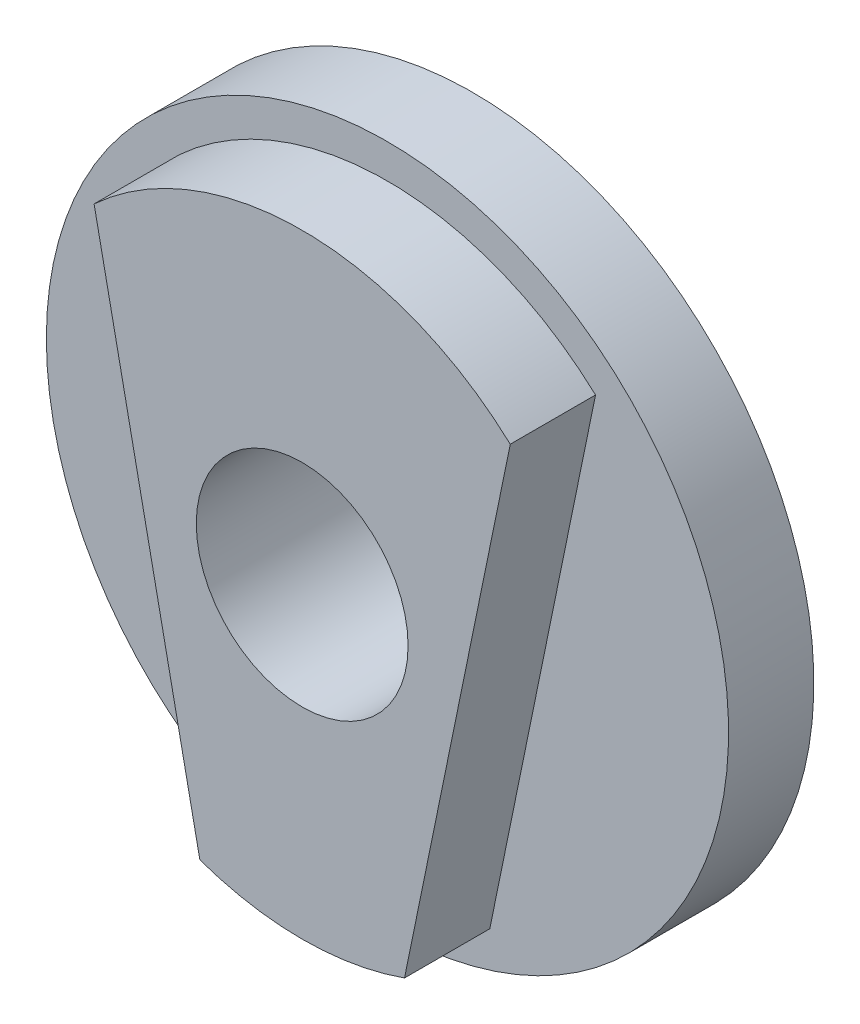
ISO-10303-21;
HEADER;
FILE_DESCRIPTION(('STEP AP214'),'2;1');
FILE_NAME('part.step','',(''),(''),'','','');
FILE_SCHEMA(('AUTOMOTIVE_DESIGN { 1 0 10303 214 1 1 1 1 }'));
ENDSEC;
DATA;
#1=APPLICATION_CONTEXT('core data for automotive mechanical design processes');
#2=APPLICATION_PROTOCOL_DEFINITION('international standard','automotive_design',2000,#1);
#3=PRODUCT_CONTEXT('',#1,'mechanical');
#4=PRODUCT('Part','Part','',(#3));
#5=PRODUCT_RELATED_PRODUCT_CATEGORY('part','',(#4));
#6=PRODUCT_DEFINITION_FORMATION('','',#4);
#7=PRODUCT_DEFINITION_CONTEXT('part definition',#1,'design');
#8=PRODUCT_DEFINITION('design','',#6,#7);
#9=PRODUCT_DEFINITION_SHAPE('','',#8);
#10=(LENGTH_UNIT() NAMED_UNIT(*) SI_UNIT(.MILLI.,.METRE.));
#11=(NAMED_UNIT(*) PLANE_ANGLE_UNIT() SI_UNIT($,.RADIAN.));
#12=(NAMED_UNIT(*) SI_UNIT($,.STERADIAN.) SOLID_ANGLE_UNIT());
#13=UNCERTAINTY_MEASURE_WITH_UNIT(LENGTH_MEASURE(1.E-05),#10,'distance_accuracy_value','');
#14=(GEOMETRIC_REPRESENTATION_CONTEXT(3) GLOBAL_UNCERTAINTY_ASSIGNED_CONTEXT((#13)) GLOBAL_UNIT_ASSIGNED_CONTEXT((#10,
#11,#12)) REPRESENTATION_CONTEXT('',''));
#15=CARTESIAN_POINT('',(0.,0.,0.));
#16=DIRECTION('',(0.,0.,1.));
#17=DIRECTION('',(1.,0.,0.));
#18=AXIS2_PLACEMENT_3D('',#15,#16,#17);
#19=CARTESIAN_POINT('',(1.,0.,0.425));
#20=DIRECTION('',(0.,0.,1.));
#21=DIRECTION('',(1.,0.,0.));
#22=AXIS2_PLACEMENT_3D('',#19,#20,#21);
#23=PLANE('',#22);
#24=CARTESIAN_POINT('',(0.,0.,0.425));
#25=DIRECTION('',(0.,0.,-1.));
#26=DIRECTION('',(-1.,0.,0.));
#27=AXIS2_PLACEMENT_3D('',#24,#25,#26);
#28=CIRCLE('',#27,1.);
#29=CARTESIAN_POINT('',(-1.,0.,0.425));
#30=VERTEX_POINT('',#29);
#31=EDGE_CURVE('E11',#30,#30,#28,.T.);
#32=ORIENTED_EDGE('',*,*,#31,.F.);
#33=EDGE_LOOP('',(#32));
#34=FACE_BOUND('',#33,.T.);
#35=DIRECTION('',(0.201077921145965,0.979575249599344,0.));
#36=VECTOR('',#35,1.);
#37=CARTESIAN_POINT('',(0.610011396574978,0.661729624581403,0.425));
#38=LINE('',#37,#36);
#39=CARTESIAN_POINT('',(0.3,-0.848528137423857,0.425));
#40=VERTEX_POINT('',#39);
#41=CARTESIAN_POINT('',(0.610011396574979,0.661729624581404,0.425));
#42=VERTEX_POINT('',#41);
#43=EDGE_CURVE('E91',#40,#42,#38,.T.);
#44=ORIENTED_EDGE('',*,*,#43,.F.);
#45=CARTESIAN_POINT('',(0.,0.,0.425));
#46=DIRECTION('',(0.,0.,1.));
#47=DIRECTION('',(1.,0.,0.));
#48=AXIS2_PLACEMENT_3D('',#45,#46,#47);
#49=CIRCLE('',#48,0.899999999999999);
#50=CARTESIAN_POINT('',(-0.299999999999994,-0.848528137423857,0.425));
#51=VERTEX_POINT('',#50);
#52=EDGE_CURVE('E102',#51,#40,#49,.T.);
#53=ORIENTED_EDGE('',*,*,#52,.F.);
#54=DIRECTION('',(0.201077921145972,-0.979575249599343,0.));
#55=VECTOR('',#54,1.);
#56=CARTESIAN_POINT('',(-0.610011396574983,0.661729624581403,0.425));
#57=LINE('',#56,#55);
#58=CARTESIAN_POINT('',(-0.610011396574983,0.661729624581403,0.425));
#59=VERTEX_POINT('',#58);
#60=EDGE_CURVE('E72',#59,#51,#57,.T.);
#61=ORIENTED_EDGE('',*,*,#60,.F.);
#62=CARTESIAN_POINT('',(0.,0.,0.425));
#63=DIRECTION('',(0.,0.,1.));
#64=DIRECTION('',(1.,0.,0.));
#65=AXIS2_PLACEMENT_3D('',#62,#63,#64);
#66=CIRCLE('',#65,0.900000000000001);
#67=EDGE_CURVE('E107',#42,#59,#66,.T.);
#68=ORIENTED_EDGE('',*,*,#67,.F.);
#69=EDGE_LOOP('',(#44,#53,#61,#68));
#70=FACE_BOUND('',#69,.T.);
#71=ADVANCED_FACE('F35',(#34,#70),#23,.T.);
#72=CARTESIAN_POINT('',(0.,0.,0.425));
#73=DIRECTION('',(0.,0.,-1.));
#74=DIRECTION('',(-1.,0.,0.));
#75=AXIS2_PLACEMENT_3D('',#72,#73,#74);
#76=CYLINDRICAL_SURFACE('',#75,1.);
#77=ORIENTED_EDGE('',*,*,#31,.T.);
#78=EDGE_LOOP('',(#77));
#79=FACE_BOUND('',#78,.T.);
#80=CARTESIAN_POINT('',(0.,0.,0.175));
#81=DIRECTION('',(0.,0.,-1.));
#82=DIRECTION('',(-1.,0.,0.));
#83=AXIS2_PLACEMENT_3D('',#80,#81,#82);
#84=CIRCLE('',#83,1.);
#85=CARTESIAN_POINT('',(-1.,0.,0.175));
#86=VERTEX_POINT('',#85);
#87=EDGE_CURVE('E43',#86,#86,#84,.T.);
#88=ORIENTED_EDGE('',*,*,#87,.F.);
#89=EDGE_LOOP('',(#88));
#90=FACE_BOUND('',#89,.T.);
#91=ADVANCED_FACE('F37',(#79,#90),#76,.T.);
#92=CARTESIAN_POINT('',(0.,0.,0.175));
#93=DIRECTION('',(0.,0.,-1.));
#94=DIRECTION('',(-1.,0.,0.));
#95=AXIS2_PLACEMENT_3D('',#92,#93,#94);
#96=PLANE('',#95);
#97=CARTESIAN_POINT('',(0.,0.,0.175));
#98=DIRECTION('',(0.,0.,-1.));
#99=DIRECTION('',(-1.,0.,0.));
#100=AXIS2_PLACEMENT_3D('',#97,#98,#99);
#101=CIRCLE('',#100,0.3105);
#102=CARTESIAN_POINT('',(-0.3105,0.,0.175));
#103=VERTEX_POINT('',#102);
#104=EDGE_CURVE('E105',#103,#103,#101,.T.);
#105=ORIENTED_EDGE('',*,*,#104,.F.);
#106=EDGE_LOOP('',(#105));
#107=FACE_BOUND('',#106,.T.);
#108=ORIENTED_EDGE('',*,*,#87,.T.);
#109=EDGE_LOOP('',(#108));
#110=FACE_BOUND('',#109,.T.);
#111=ADVANCED_FACE('F115',(#107,#110),#96,.T.);
#112=CARTESIAN_POINT('',(0.,0.,0.675));
#113=DIRECTION('',(0.,0.,-1.));
#114=DIRECTION('',(-1.,0.,0.));
#115=AXIS2_PLACEMENT_3D('',#112,#113,#114);
#116=CYLINDRICAL_SURFACE('',#115,0.899999999999999);
#117=ORIENTED_EDGE('',*,*,#52,.T.);
#118=DIRECTION('',(0.,0.,-1.));
#119=VECTOR('',#118,1.);
#120=CARTESIAN_POINT('',(0.3,-0.848528137423857,0.675));
#121=LINE('',#120,#119);
#122=CARTESIAN_POINT('',(0.3,-0.848528137423857,0.675));
#123=VERTEX_POINT('',#122);
#124=EDGE_CURVE('E94',#123,#40,#121,.T.);
#125=ORIENTED_EDGE('',*,*,#124,.F.);
#126=CARTESIAN_POINT('',(0.,0.,0.675));
#127=DIRECTION('',(0.,0.,1.));
#128=DIRECTION('',(1.,0.,0.));
#129=AXIS2_PLACEMENT_3D('',#126,#127,#128);
#130=CIRCLE('',#129,0.899999999999999);
#131=CARTESIAN_POINT('',(-0.299999999999994,-0.848528137423857,0.675));
#132=VERTEX_POINT('',#131);
#133=EDGE_CURVE('E84',#132,#123,#130,.T.);
#134=ORIENTED_EDGE('',*,*,#133,.F.);
#135=DIRECTION('',(0.,0.,-1.));
#136=VECTOR('',#135,1.);
#137=CARTESIAN_POINT('',(-0.299999999999994,-0.848528137423857,0.675));
#138=LINE('',#137,#136);
#139=EDGE_CURVE('E98',#132,#51,#138,.T.);
#140=ORIENTED_EDGE('',*,*,#139,.T.);
#141=EDGE_LOOP('',(#117,#125,#134,#140));
#142=FACE_BOUND('',#141,.T.);
#143=ADVANCED_FACE('F123',(#142),#116,.T.);
#144=CARTESIAN_POINT('',(0.610011396574978,0.661729624581403,0.675));
#145=DIRECTION('',(-0.979575249599344,0.201077921145965,0.));
#146=DIRECTION('',(-0.201077921145965,-0.979575249599344,0.));
#147=AXIS2_PLACEMENT_3D('',#144,#145,#146);
#148=PLANE('',#147);
#149=ORIENTED_EDGE('',*,*,#43,.T.);
#150=DIRECTION('',(0.,0.,-1.));
#151=VECTOR('',#150,1.);
#152=CARTESIAN_POINT('',(0.610011396574979,0.661729624581404,0.675));
#153=LINE('',#152,#151);
#154=CARTESIAN_POINT('',(0.610011396574979,0.661729624581404,0.675));
#155=VERTEX_POINT('',#154);
#156=EDGE_CURVE('E88',#155,#42,#153,.T.);
#157=ORIENTED_EDGE('',*,*,#156,.F.);
#158=DIRECTION('',(0.201077921145965,0.979575249599344,0.));
#159=VECTOR('',#158,1.);
#160=CARTESIAN_POINT('',(0.610011396574978,0.661729624581403,0.675));
#161=LINE('',#160,#159);
#162=EDGE_CURVE('E79',#123,#155,#161,.T.);
#163=ORIENTED_EDGE('',*,*,#162,.F.);
#164=ORIENTED_EDGE('',*,*,#124,.T.);
#165=EDGE_LOOP('',(#149,#157,#163,#164));
#166=FACE_BOUND('',#165,.T.);
#167=ADVANCED_FACE('F89',(#166),#148,.F.);
#168=CARTESIAN_POINT('',(0.,0.,0.675));
#169=DIRECTION('',(0.,0.,-1.));
#170=DIRECTION('',(-1.,0.,0.));
#171=AXIS2_PLACEMENT_3D('',#168,#169,#170);
#172=CYLINDRICAL_SURFACE('',#171,0.900000000000001);
#173=ORIENTED_EDGE('',*,*,#67,.T.);
#174=DIRECTION('',(0.,0.,-1.));
#175=VECTOR('',#174,1.);
#176=CARTESIAN_POINT('',(-0.610011396574983,0.661729624581403,0.675));
#177=LINE('',#176,#175);
#178=CARTESIAN_POINT('',(-0.610011396574983,0.661729624581403,0.675));
#179=VERTEX_POINT('',#178);
#180=EDGE_CURVE('E50',#179,#59,#177,.T.);
#181=ORIENTED_EDGE('',*,*,#180,.F.);
#182=CARTESIAN_POINT('',(0.,0.,0.675));
#183=DIRECTION('',(0.,0.,1.));
#184=DIRECTION('',(1.,0.,0.));
#185=AXIS2_PLACEMENT_3D('',#182,#183,#184);
#186=CIRCLE('',#185,0.900000000000001);
#187=EDGE_CURVE('E82',#155,#179,#186,.T.);
#188=ORIENTED_EDGE('',*,*,#187,.F.);
#189=ORIENTED_EDGE('',*,*,#156,.T.);
#190=EDGE_LOOP('',(#173,#181,#188,#189));
#191=FACE_BOUND('',#190,.T.);
#192=ADVANCED_FACE('F96',(#191),#172,.T.);
#193=CARTESIAN_POINT('',(-0.610011396574983,0.661729624581403,0.675));
#194=DIRECTION('',(0.979575249599343,0.201077921145972,0.));
#195=DIRECTION('',(-0.201077921145972,0.979575249599343,0.));
#196=AXIS2_PLACEMENT_3D('',#193,#194,#195);
#197=PLANE('',#196);
#198=ORIENTED_EDGE('',*,*,#60,.T.);
#199=ORIENTED_EDGE('',*,*,#139,.F.);
#200=DIRECTION('',(0.201077921145972,-0.979575249599343,0.));
#201=VECTOR('',#200,1.);
#202=CARTESIAN_POINT('',(-0.610011396574983,0.661729624581403,0.675));
#203=LINE('',#202,#201);
#204=EDGE_CURVE('E58',#179,#132,#203,.T.);
#205=ORIENTED_EDGE('',*,*,#204,.F.);
#206=ORIENTED_EDGE('',*,*,#180,.T.);
#207=EDGE_LOOP('',(#198,#199,#205,#206));
#208=FACE_BOUND('',#207,.T.);
#209=ADVANCED_FACE('F131',(#208),#197,.F.);
#210=CARTESIAN_POINT('',(0.,0.,0.675));
#211=DIRECTION('',(0.,0.,1.));
#212=DIRECTION('',(1.,0.,0.));
#213=AXIS2_PLACEMENT_3D('',#210,#211,#212);
#214=PLANE('',#213);
#215=CARTESIAN_POINT('',(0.,0.,0.675));
#216=DIRECTION('',(0.,0.,1.));
#217=DIRECTION('',(1.,0.,0.));
#218=AXIS2_PLACEMENT_3D('',#215,#216,#217);
#219=CIRCLE('',#218,0.3105);
#220=CARTESIAN_POINT('',(0.3105,0.,0.675));
#221=VERTEX_POINT('',#220);
#222=EDGE_CURVE('E193',#221,#221,#219,.T.);
#223=ORIENTED_EDGE('',*,*,#222,.F.);
#224=EDGE_LOOP('',(#223));
#225=FACE_BOUND('',#224,.T.);
#226=ORIENTED_EDGE('',*,*,#133,.T.);
#227=ORIENTED_EDGE('',*,*,#162,.T.);
#228=ORIENTED_EDGE('',*,*,#187,.T.);
#229=ORIENTED_EDGE('',*,*,#204,.T.);
#230=EDGE_LOOP('',(#226,#227,#228,#229));
#231=FACE_BOUND('',#230,.T.);
#232=ADVANCED_FACE('F80',(#225,#231),#214,.T.);
#233=CARTESIAN_POINT('',(0.,0.,0.676));
#234=DIRECTION('',(0.,0.,-1.));
#235=DIRECTION('',(-1.,0.,0.));
#236=AXIS2_PLACEMENT_3D('',#233,#234,#235);
#237=CYLINDRICAL_SURFACE('',#236,0.3105);
#238=ORIENTED_EDGE('',*,*,#104,.T.);
#239=EDGE_LOOP('',(#238));
#240=FACE_BOUND('',#239,.T.);
#241=ORIENTED_EDGE('',*,*,#222,.T.);
#242=EDGE_LOOP('',(#241));
#243=FACE_BOUND('',#242,.T.);
#244=ADVANCED_FACE('F138',(#240,#243),#237,.F.);
#245=CLOSED_SHELL('',(#71,#91,#111,#143,#167,#192,#209,#232,#244));
#246=MANIFOLD_SOLID_BREP('B2',#245);
#247=ADVANCED_BREP_SHAPE_REPRESENTATION('',(#18,#246),#14);
#248=SHAPE_DEFINITION_REPRESENTATION(#9,#247);
ENDSEC;
END-ISO-10303-21;
